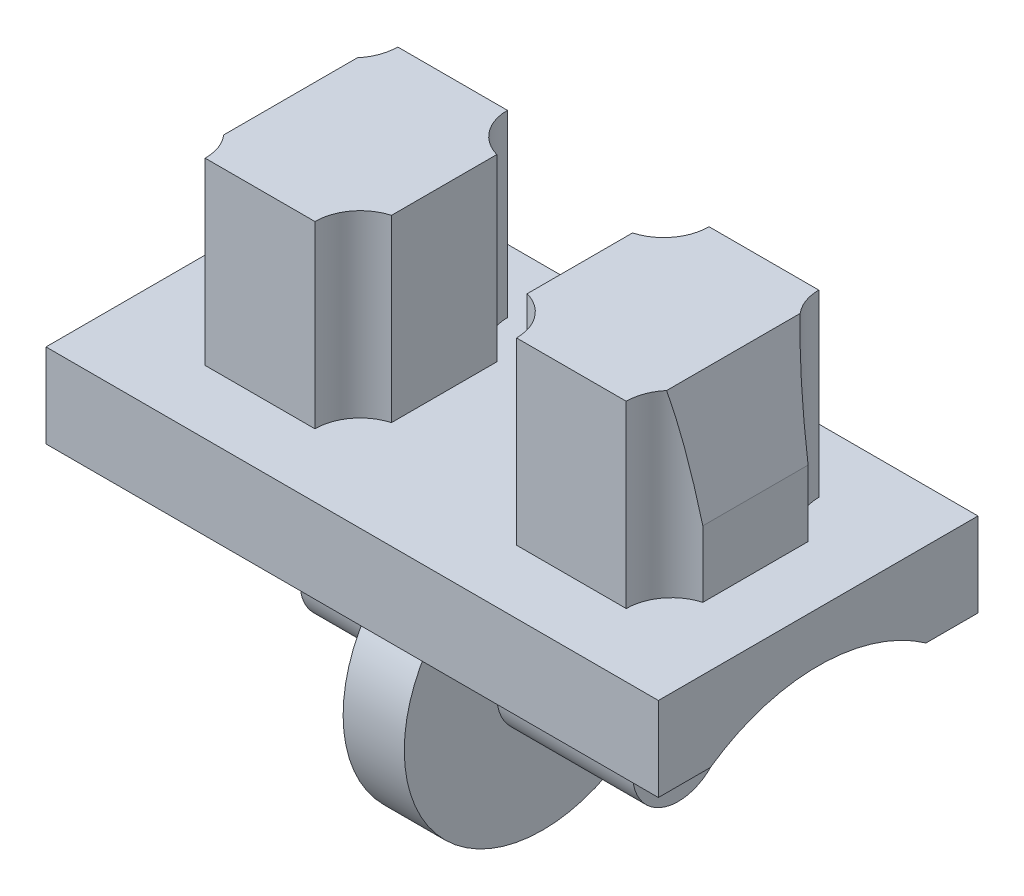
ISO-10303-21;
HEADER;
FILE_DESCRIPTION(('STEP AP214'),'2;1');
FILE_NAME('part.step','',(''),(''),'','','');
FILE_SCHEMA(('AUTOMOTIVE_DESIGN { 1 0 10303 214 1 1 1 1 }'));
ENDSEC;
DATA;
#1=APPLICATION_CONTEXT('core data for automotive mechanical design processes');
#2=APPLICATION_PROTOCOL_DEFINITION('international standard','automotive_design',2000,#1);
#3=PRODUCT_CONTEXT('',#1,'mechanical');
#4=PRODUCT('Part','Part','',(#3));
#5=PRODUCT_RELATED_PRODUCT_CATEGORY('part','',(#4));
#6=PRODUCT_DEFINITION_FORMATION('','',#4);
#7=PRODUCT_DEFINITION_CONTEXT('part definition',#1,'design');
#8=PRODUCT_DEFINITION('design','',#6,#7);
#9=PRODUCT_DEFINITION_SHAPE('','',#8);
#10=(LENGTH_UNIT() NAMED_UNIT(*) SI_UNIT(.MILLI.,.METRE.));
#11=(NAMED_UNIT(*) PLANE_ANGLE_UNIT() SI_UNIT($,.RADIAN.));
#12=(NAMED_UNIT(*) SI_UNIT($,.STERADIAN.) SOLID_ANGLE_UNIT());
#13=UNCERTAINTY_MEASURE_WITH_UNIT(LENGTH_MEASURE(1.E-05),#10,'distance_accuracy_value','');
#14=(GEOMETRIC_REPRESENTATION_CONTEXT(3) GLOBAL_UNCERTAINTY_ASSIGNED_CONTEXT((#13)) GLOBAL_UNIT_ASSIGNED_CONTEXT((#10,
#11,#12)) REPRESENTATION_CONTEXT('',''));
#15=CARTESIAN_POINT('',(0.,0.,0.));
#16=DIRECTION('',(0.,0.,1.));
#17=DIRECTION('',(1.,0.,0.));
#18=AXIS2_PLACEMENT_3D('',#15,#16,#17);
#19=CARTESIAN_POINT('',(6.485,9.41,2.44));
#20=DIRECTION('',(0.,-1.,0.));
#21=DIRECTION('',(0.,0.,-1.));
#22=AXIS2_PLACEMENT_3D('',#19,#20,#21);
#23=CYLINDRICAL_SURFACE('',#22,1.15);
#24=DIRECTION('',(0.,-1.,0.));
#25=VECTOR('',#24,1.);
#26=CARTESIAN_POINT('',(6.17,9.41,1.33398236903745));
#27=LINE('',#26,#25);
#28=CARTESIAN_POINT('',(6.17,6.54,1.33398236903745));
#29=VERTEX_POINT('',#28);
#30=CARTESIAN_POINT('',(6.17,4.86,1.33398236903745));
#31=VERTEX_POINT('',#30);
#32=EDGE_CURVE('E253',#29,#31,#27,.T.);
#33=ORIENTED_EDGE('',*,*,#32,.F.);
#34=CARTESIAN_POINT('',(6.485,4.92248016374453,2.44));
#35=DIRECTION('',(0.981560518740634,0.191151636272402,0.));
#36=DIRECTION('',(0.191151636272402,-0.981560518740634,0.));
#37=AXIS2_PLACEMENT_3D('',#34,#35,#36);
#38=ELLIPSE('',#37,6.01616613085741,1.15);
#39=CARTESIAN_POINT('',(5.611088770761,9.41,1.69248467346148));
#40=VERTEX_POINT('',#39);
#41=EDGE_CURVE('E242',#29,#40,#38,.T.);
#42=ORIENTED_EDGE('',*,*,#41,.T.);
#43=CARTESIAN_POINT('',(6.485,9.41,2.44));
#44=DIRECTION('',(0.,1.,0.));
#45=DIRECTION('',(0.,0.,-1.));
#46=AXIS2_PLACEMENT_3D('',#43,#44,#45);
#47=CIRCLE('',#46,1.15);
#48=CARTESIAN_POINT('',(5.335,9.41,2.44));
#49=VERTEX_POINT('',#48);
#50=EDGE_CURVE('E250',#40,#49,#47,.T.);
#51=ORIENTED_EDGE('',*,*,#50,.T.);
#52=DIRECTION('',(0.,-1.,0.));
#53=VECTOR('',#52,1.);
#54=CARTESIAN_POINT('',(5.335,9.41,2.44));
#55=LINE('',#54,#53);
#56=CARTESIAN_POINT('',(5.335,4.86,2.44));
#57=VERTEX_POINT('',#56);
#58=EDGE_CURVE('E309',#49,#57,#55,.T.);
#59=ORIENTED_EDGE('',*,*,#58,.T.);
#60=CARTESIAN_POINT('',(6.485,4.86,2.44));
#61=DIRECTION('',(0.,1.,0.));
#62=DIRECTION('',(0.,0.,-1.));
#63=AXIS2_PLACEMENT_3D('',#60,#61,#62);
#64=CIRCLE('',#63,1.15);
#65=EDGE_CURVE('E283',#31,#57,#64,.T.);
#66=ORIENTED_EDGE('',*,*,#65,.F.);
#67=EDGE_LOOP('',(#33,#42,#51,#59,#66));
#68=FACE_BOUND('',#67,.T.);
#69=ADVANCED_FACE('F35',(#68),#23,.F.);
#70=CARTESIAN_POINT('',(6.17,9.41,-1.33398236903745));
#71=DIRECTION('',(1.,0.,0.));
#72=DIRECTION('',(0.,0.,-1.));
#73=AXIS2_PLACEMENT_3D('',#70,#71,#72);
#74=PLANE('',#73);
#75=DIRECTION('',(0.,-1.,0.));
#76=VECTOR('',#75,1.);
#77=CARTESIAN_POINT('',(6.17,9.41,-1.33398236903745));
#78=LINE('',#77,#76);
#79=CARTESIAN_POINT('',(6.17,6.54,-1.33398236903745));
#80=VERTEX_POINT('',#79);
#81=CARTESIAN_POINT('',(6.17,4.86,-1.33398236903745));
#82=VERTEX_POINT('',#81);
#83=EDGE_CURVE('E306',#80,#82,#78,.T.);
#84=ORIENTED_EDGE('',*,*,#83,.F.);
#85=DIRECTION('',(0.,0.,1.));
#86=VECTOR('',#85,1.);
#87=CARTESIAN_POINT('',(6.17,6.54,-2.5));
#88=LINE('',#87,#86);
#89=EDGE_CURVE('E977',#80,#29,#88,.T.);
#90=ORIENTED_EDGE('',*,*,#89,.T.);
#91=ORIENTED_EDGE('',*,*,#32,.T.);
#92=DIRECTION('',(0.,0.,1.));
#93=VECTOR('',#92,1.);
#94=CARTESIAN_POINT('',(6.17,4.86,-1.33398236903745));
#95=LINE('',#94,#93);
#96=EDGE_CURVE('E286',#82,#31,#95,.T.);
#97=ORIENTED_EDGE('',*,*,#96,.F.);
#98=EDGE_LOOP('',(#84,#90,#91,#97));
#99=FACE_BOUND('',#98,.T.);
#100=ADVANCED_FACE('F544',(#99),#74,.T.);
#101=CARTESIAN_POINT('',(6.485,9.41,-2.44));
#102=DIRECTION('',(0.,-1.,0.));
#103=DIRECTION('',(0.,0.,-1.));
#104=AXIS2_PLACEMENT_3D('',#101,#102,#103);
#105=CYLINDRICAL_SURFACE('',#104,1.15);
#106=CARTESIAN_POINT('',(6.485,9.41,-2.44));
#107=DIRECTION('',(0.,1.,0.));
#108=DIRECTION('',(0.,0.,-1.));
#109=AXIS2_PLACEMENT_3D('',#106,#107,#108);
#110=CIRCLE('',#109,1.15);
#111=CARTESIAN_POINT('',(5.335,9.41,-2.44));
#112=VERTEX_POINT('',#111);
#113=CARTESIAN_POINT('',(5.611088770761,9.41,-1.69248467346148));
#114=VERTEX_POINT('',#113);
#115=EDGE_CURVE('E261',#112,#114,#110,.T.);
#116=ORIENTED_EDGE('',*,*,#115,.T.);
#117=CARTESIAN_POINT('',(6.485,4.92248016374453,-2.44));
#118=DIRECTION('',(0.981560518740634,0.191151636272402,0.));
#119=DIRECTION('',(0.191151636272402,-0.981560518740634,0.));
#120=AXIS2_PLACEMENT_3D('',#117,#118,#119);
#121=ELLIPSE('',#120,6.01616613085741,1.15);
#122=EDGE_CURVE('E50',#114,#80,#121,.T.);
#123=ORIENTED_EDGE('',*,*,#122,.T.);
#124=ORIENTED_EDGE('',*,*,#83,.T.);
#125=CARTESIAN_POINT('',(6.485,4.86,-2.44));
#126=DIRECTION('',(0.,1.,0.));
#127=DIRECTION('',(0.,0.,-1.));
#128=AXIS2_PLACEMENT_3D('',#125,#126,#127);
#129=CIRCLE('',#128,1.15);
#130=CARTESIAN_POINT('',(5.335,4.86,-2.44));
#131=VERTEX_POINT('',#130);
#132=EDGE_CURVE('E289',#131,#82,#129,.T.);
#133=ORIENTED_EDGE('',*,*,#132,.F.);
#134=DIRECTION('',(0.,-1.,0.));
#135=VECTOR('',#134,1.);
#136=CARTESIAN_POINT('',(5.335,9.41,-2.44));
#137=LINE('',#136,#135);
#138=EDGE_CURVE('E304',#112,#131,#137,.T.);
#139=ORIENTED_EDGE('',*,*,#138,.F.);
#140=EDGE_LOOP('',(#116,#123,#124,#133,#139));
#141=FACE_BOUND('',#140,.T.);
#142=ADVANCED_FACE('F549',(#141),#105,.F.);
#143=CARTESIAN_POINT('',(1.405,9.41,2.44));
#144=DIRECTION('',(0.,1.,0.));
#145=DIRECTION('',(0.,0.,1.));
#146=AXIS2_PLACEMENT_3D('',#143,#144,#145);
#147=PLANE('',#146);
#148=ORIENTED_EDGE('',*,*,#50,.F.);
#149=DIRECTION('',(0.,0.,-1.));
#150=VECTOR('',#149,1.);
#151=CARTESIAN_POINT('',(5.611088770761,9.41,2.44));
#152=LINE('',#151,#150);
#153=EDGE_CURVE('E11',#40,#114,#152,.T.);
#154=ORIENTED_EDGE('',*,*,#153,.T.);
#155=ORIENTED_EDGE('',*,*,#115,.F.);
#156=DIRECTION('',(1.,0.,0.));
#157=VECTOR('',#156,1.);
#158=CARTESIAN_POINT('',(2.555,9.41,-2.44));
#159=LINE('',#158,#157);
#160=CARTESIAN_POINT('',(2.555,9.41,-2.44));
#161=VERTEX_POINT('',#160);
#162=EDGE_CURVE('E263',#161,#112,#159,.T.);
#163=ORIENTED_EDGE('',*,*,#162,.F.);
#164=CARTESIAN_POINT('',(1.405,9.41,-2.44));
#165=DIRECTION('',(0.,1.,0.));
#166=DIRECTION('',(0.,0.,1.));
#167=AXIS2_PLACEMENT_3D('',#164,#165,#166);
#168=CIRCLE('',#167,1.15);
#169=CARTESIAN_POINT('',(1.72,9.41,-1.33398236903745));
#170=VERTEX_POINT('',#169);
#171=EDGE_CURVE('E271',#170,#161,#168,.T.);
#172=ORIENTED_EDGE('',*,*,#171,.F.);
#173=DIRECTION('',(0.,0.,-1.));
#174=VECTOR('',#173,1.);
#175=CARTESIAN_POINT('',(1.72,9.41,-1.33398236903745));
#176=LINE('',#175,#174);
#177=CARTESIAN_POINT('',(1.72,9.41,1.33398236903745));
#178=VERTEX_POINT('',#177);
#179=EDGE_CURVE('E274',#178,#170,#176,.T.);
#180=ORIENTED_EDGE('',*,*,#179,.F.);
#181=CARTESIAN_POINT('',(1.405,9.41,2.44));
#182=DIRECTION('',(0.,1.,0.));
#183=DIRECTION('',(0.,0.,1.));
#184=AXIS2_PLACEMENT_3D('',#181,#182,#183);
#185=CIRCLE('',#184,1.15);
#186=CARTESIAN_POINT('',(2.555,9.41,2.44));
#187=VERTEX_POINT('',#186);
#188=EDGE_CURVE('E265',#187,#178,#185,.T.);
#189=ORIENTED_EDGE('',*,*,#188,.F.);
#190=DIRECTION('',(-1.,0.,0.));
#191=VECTOR('',#190,1.);
#192=CARTESIAN_POINT('',(2.555,9.41,2.44));
#193=LINE('',#192,#191);
#194=EDGE_CURVE('E260',#49,#187,#193,.T.);
#195=ORIENTED_EDGE('',*,*,#194,.F.);
#196=EDGE_LOOP('',(#148,#154,#155,#163,#172,#180,#189,#195));
#197=FACE_BOUND('',#196,.T.);
#198=ADVANCED_FACE('F257',(#197),#147,.T.);
#199=CARTESIAN_POINT('',(7.76,4.86,4.05));
#200=DIRECTION('',(0.,-1.,0.));
#201=DIRECTION('',(0.,0.,-1.));
#202=AXIS2_PLACEMENT_3D('',#199,#200,#201);
#203=PLANE('',#202);
#204=DIRECTION('',(-1.,0.,0.));
#205=VECTOR('',#204,1.);
#206=CARTESIAN_POINT('',(2.555,4.86,2.44));
#207=LINE('',#206,#205);
#208=CARTESIAN_POINT('',(2.555,4.86,2.44));
#209=VERTEX_POINT('',#208);
#210=EDGE_CURVE('E280',#57,#209,#207,.T.);
#211=ORIENTED_EDGE('',*,*,#210,.T.);
#212=CARTESIAN_POINT('',(1.405,4.86,2.44));
#213=DIRECTION('',(0.,1.,0.));
#214=DIRECTION('',(0.,0.,1.));
#215=AXIS2_PLACEMENT_3D('',#212,#213,#214);
#216=CIRCLE('',#215,1.15);
#217=CARTESIAN_POINT('',(1.72,4.86,1.33398236903745));
#218=VERTEX_POINT('',#217);
#219=EDGE_CURVE('E254',#209,#218,#216,.T.);
#220=ORIENTED_EDGE('',*,*,#219,.T.);
#221=DIRECTION('',(0.,0.,-1.));
#222=VECTOR('',#221,1.);
#223=CARTESIAN_POINT('',(1.72,4.86,-1.33398236903745));
#224=LINE('',#223,#222);
#225=CARTESIAN_POINT('',(1.72,4.86,-1.33398236903745));
#226=VERTEX_POINT('',#225);
#227=EDGE_CURVE('E296',#218,#226,#224,.T.);
#228=ORIENTED_EDGE('',*,*,#227,.T.);
#229=CARTESIAN_POINT('',(1.405,4.86,-2.44));
#230=DIRECTION('',(0.,1.,0.));
#231=DIRECTION('',(0.,0.,1.));
#232=AXIS2_PLACEMENT_3D('',#229,#230,#231);
#233=CIRCLE('',#232,1.15);
#234=CARTESIAN_POINT('',(2.555,4.86,-2.44));
#235=VERTEX_POINT('',#234);
#236=EDGE_CURVE('E57',#226,#235,#233,.T.);
#237=ORIENTED_EDGE('',*,*,#236,.T.);
#238=DIRECTION('',(1.,0.,0.));
#239=VECTOR('',#238,1.);
#240=CARTESIAN_POINT('',(2.555,4.86,-2.44));
#241=LINE('',#240,#239);
#242=EDGE_CURVE('E292',#235,#131,#241,.T.);
#243=ORIENTED_EDGE('',*,*,#242,.T.);
#244=ORIENTED_EDGE('',*,*,#132,.T.);
#245=ORIENTED_EDGE('',*,*,#96,.T.);
#246=ORIENTED_EDGE('',*,*,#65,.T.);
#247=EDGE_LOOP('',(#211,#220,#228,#237,#243,#244,#245,#246));
#248=FACE_BOUND('',#247,.T.);
#249=DIRECTION('',(0.,0.,1.));
#250=VECTOR('',#249,1.);
#251=CARTESIAN_POINT('',(-7.76,4.86,4.05));
#252=LINE('',#251,#250);
#253=CARTESIAN_POINT('',(-7.76,4.86,-4.05));
#254=VERTEX_POINT('',#253);
#255=CARTESIAN_POINT('',(-7.76,4.86,4.05));
#256=VERTEX_POINT('',#255);
#257=EDGE_CURVE('E412',#254,#256,#252,.T.);
#258=ORIENTED_EDGE('',*,*,#257,.T.);
#259=DIRECTION('',(-1.,0.,0.));
#260=VECTOR('',#259,1.);
#261=CARTESIAN_POINT('',(7.76,4.86,4.05));
#262=LINE('',#261,#260);
#263=CARTESIAN_POINT('',(7.76,4.86,4.05));
#264=VERTEX_POINT('',#263);
#265=EDGE_CURVE('E432',#264,#256,#262,.T.);
#266=ORIENTED_EDGE('',*,*,#265,.F.);
#267=DIRECTION('',(0.,0.,1.));
#268=VECTOR('',#267,1.);
#269=CARTESIAN_POINT('',(7.76,4.86,4.05));
#270=LINE('',#269,#268);
#271=CARTESIAN_POINT('',(7.76,4.86,-4.05));
#272=VERTEX_POINT('',#271);
#273=EDGE_CURVE('E394',#272,#264,#270,.T.);
#274=ORIENTED_EDGE('',*,*,#273,.F.);
#275=DIRECTION('',(-1.,0.,0.));
#276=VECTOR('',#275,1.);
#277=CARTESIAN_POINT('',(7.76,4.86,-4.05));
#278=LINE('',#277,#276);
#279=EDGE_CURVE('E435',#272,#254,#278,.T.);
#280=ORIENTED_EDGE('',*,*,#279,.T.);
#281=EDGE_LOOP('',(#258,#266,#274,#280));
#282=FACE_BOUND('',#281,.T.);
#283=CARTESIAN_POINT('',(-1.405,4.86,2.44));
#284=DIRECTION('',(0.,-1.,0.));
#285=DIRECTION('',(0.,0.,1.));
#286=AXIS2_PLACEMENT_3D('',#283,#284,#285);
#287=CIRCLE('',#286,1.15);
#288=CARTESIAN_POINT('',(-2.555,4.86,2.44));
#289=VERTEX_POINT('',#288);
#290=CARTESIAN_POINT('',(-1.72,4.86,1.33398236903745));
#291=VERTEX_POINT('',#290);
#292=EDGE_CURVE('E321',#289,#291,#287,.T.);
#293=ORIENTED_EDGE('',*,*,#292,.F.);
#294=DIRECTION('',(1.,0.,0.));
#295=VECTOR('',#294,1.);
#296=CARTESIAN_POINT('',(-2.555,4.86,2.44));
#297=LINE('',#296,#295);
#298=CARTESIAN_POINT('',(-5.335,4.86,2.44));
#299=VERTEX_POINT('',#298);
#300=EDGE_CURVE('E326',#299,#289,#297,.T.);
#301=ORIENTED_EDGE('',*,*,#300,.F.);
#302=CARTESIAN_POINT('',(-6.485,4.86,2.44));
#303=DIRECTION('',(0.,-1.,0.));
#304=DIRECTION('',(0.,0.,-1.));
#305=AXIS2_PLACEMENT_3D('',#302,#303,#304);
#306=CIRCLE('',#305,1.15);
#307=CARTESIAN_POINT('',(-6.17,4.86,1.33398236903745));
#308=VERTEX_POINT('',#307);
#309=EDGE_CURVE('E357',#308,#299,#306,.T.);
#310=ORIENTED_EDGE('',*,*,#309,.F.);
#311=DIRECTION('',(0.,0.,1.));
#312=VECTOR('',#311,1.);
#313=CARTESIAN_POINT('',(-6.17,4.86,-1.33398236903745));
#314=LINE('',#313,#312);
#315=CARTESIAN_POINT('',(-6.17,4.86,-1.33398236903745));
#316=VERTEX_POINT('',#315);
#317=EDGE_CURVE('E354',#316,#308,#314,.T.);
#318=ORIENTED_EDGE('',*,*,#317,.F.);
#319=CARTESIAN_POINT('',(-6.485,4.86,-2.44));
#320=DIRECTION('',(0.,-1.,0.));
#321=DIRECTION('',(0.,0.,-1.));
#322=AXIS2_PLACEMENT_3D('',#319,#320,#321);
#323=CIRCLE('',#322,1.15);
#324=CARTESIAN_POINT('',(-5.335,4.86,-2.44));
#325=VERTEX_POINT('',#324);
#326=EDGE_CURVE('E351',#325,#316,#323,.T.);
#327=ORIENTED_EDGE('',*,*,#326,.F.);
#328=DIRECTION('',(-1.,0.,0.));
#329=VECTOR('',#328,1.);
#330=CARTESIAN_POINT('',(-2.555,4.86,-2.44));
#331=LINE('',#330,#329);
#332=CARTESIAN_POINT('',(-2.555,4.86,-2.44));
#333=VERTEX_POINT('',#332);
#334=EDGE_CURVE('E348',#333,#325,#331,.T.);
#335=ORIENTED_EDGE('',*,*,#334,.F.);
#336=CARTESIAN_POINT('',(-1.405,4.86,-2.44));
#337=DIRECTION('',(0.,-1.,0.));
#338=DIRECTION('',(0.,0.,1.));
#339=AXIS2_PLACEMENT_3D('',#336,#337,#338);
#340=CIRCLE('',#339,1.15);
#341=CARTESIAN_POINT('',(-1.72,4.86,-1.33398236903745));
#342=VERTEX_POINT('',#341);
#343=EDGE_CURVE('E345',#342,#333,#340,.T.);
#344=ORIENTED_EDGE('',*,*,#343,.F.);
#345=DIRECTION('',(0.,0.,-1.));
#346=VECTOR('',#345,1.);
#347=CARTESIAN_POINT('',(-1.72,4.86,-1.33398236903745));
#348=LINE('',#347,#346);
#349=EDGE_CURVE('E342',#291,#342,#348,.T.);
#350=ORIENTED_EDGE('',*,*,#349,.F.);
#351=EDGE_LOOP('',(#293,#301,#310,#318,#327,#335,#344,#350));
#352=FACE_BOUND('',#351,.T.);
#353=ADVANCED_FACE('F514',(#248,#282,#352),#203,.F.);
#354=CARTESIAN_POINT('',(0.775,2.73210689330767,-2.73));
#355=DIRECTION('',(0.,0.,1.));
#356=DIRECTION('',(1.,0.,0.));
#357=AXIS2_PLACEMENT_3D('',#354,#355,#356);
#358=PLANE('',#357);
#359=DIRECTION('',(-1.,0.,0.));
#360=VECTOR('',#359,1.);
#361=CARTESIAN_POINT('',(7.76,2.73,-2.73));
#362=LINE('',#361,#360);
#363=CARTESIAN_POINT('',(0.775,2.73,-2.73));
#364=VERTEX_POINT('',#363);
#365=CARTESIAN_POINT('',(-0.775,2.73,-2.73));
#366=VERTEX_POINT('',#365);
#367=EDGE_CURVE('E446',#364,#366,#362,.T.);
#368=ORIENTED_EDGE('',*,*,#367,.F.);
#369=DIRECTION('',(0.,1.,0.));
#370=VECTOR('',#369,1.);
#371=CARTESIAN_POINT('',(0.775,2.73210689330767,-2.73));
#372=LINE('',#371,#370);
#373=CARTESIAN_POINT('',(0.775,2.19820949866022,-2.73));
#374=VERTEX_POINT('',#373);
#375=EDGE_CURVE('E465',#374,#364,#372,.T.);
#376=ORIENTED_EDGE('',*,*,#375,.F.);
#377=DIRECTION('',(-1.,0.,0.));
#378=VECTOR('',#377,1.);
#379=CARTESIAN_POINT('',(0.775,2.19820949866022,-2.73));
#380=LINE('',#379,#378);
#381=CARTESIAN_POINT('',(-0.775,2.19820949866022,-2.73));
#382=VERTEX_POINT('',#381);
#383=EDGE_CURVE('E490',#374,#382,#380,.T.);
#384=ORIENTED_EDGE('',*,*,#383,.T.);
#385=DIRECTION('',(0.,1.,0.));
#386=VECTOR('',#385,1.);
#387=CARTESIAN_POINT('',(-0.775,2.73210689330767,-2.73));
#388=LINE('',#387,#386);
#389=EDGE_CURVE('E479',#382,#366,#388,.T.);
#390=ORIENTED_EDGE('',*,*,#389,.T.);
#391=EDGE_LOOP('',(#368,#376,#384,#390));
#392=FACE_BOUND('',#391,.T.);
#393=ADVANCED_FACE('F711',(#392),#358,.F.);
#394=CARTESIAN_POINT('',(0.775,2.73210689330767,2.73));
#395=DIRECTION('',(0.,0.,-1.));
#396=DIRECTION('',(-1.,0.,0.));
#397=AXIS2_PLACEMENT_3D('',#394,#395,#396);
#398=PLANE('',#397);
#399=DIRECTION('',(-1.,0.,0.));
#400=VECTOR('',#399,1.);
#401=CARTESIAN_POINT('',(7.76,2.73,2.73));
#402=LINE('',#401,#400);
#403=CARTESIAN_POINT('',(0.775,2.73,2.73));
#404=VERTEX_POINT('',#403);
#405=CARTESIAN_POINT('',(-0.775,2.73,2.73));
#406=VERTEX_POINT('',#405);
#407=EDGE_CURVE('E429',#404,#406,#402,.T.);
#408=ORIENTED_EDGE('',*,*,#407,.T.);
#409=DIRECTION('',(0.,-1.,0.));
#410=VECTOR('',#409,1.);
#411=CARTESIAN_POINT('',(-0.775,2.73210689330767,2.73));
#412=LINE('',#411,#410);
#413=CARTESIAN_POINT('',(-0.775,2.19820949866022,2.73));
#414=VERTEX_POINT('',#413);
#415=EDGE_CURVE('E485',#406,#414,#412,.T.);
#416=ORIENTED_EDGE('',*,*,#415,.T.);
#417=DIRECTION('',(-1.,0.,0.));
#418=VECTOR('',#417,1.);
#419=CARTESIAN_POINT('',(0.775,2.19820949866022,2.73));
#420=LINE('',#419,#418);
#421=CARTESIAN_POINT('',(0.775,2.19820949866022,2.73));
#422=VERTEX_POINT('',#421);
#423=EDGE_CURVE('E475',#422,#414,#420,.T.);
#424=ORIENTED_EDGE('',*,*,#423,.F.);
#425=DIRECTION('',(0.,-1.,0.));
#426=VECTOR('',#425,1.);
#427=CARTESIAN_POINT('',(0.775,2.73210689330767,2.73));
#428=LINE('',#427,#426);
#429=EDGE_CURVE('E471',#404,#422,#428,.T.);
#430=ORIENTED_EDGE('',*,*,#429,.F.);
#431=EDGE_LOOP('',(#408,#416,#424,#430));
#432=FACE_BOUND('',#431,.T.);
#433=ADVANCED_FACE('F825',(#432),#398,.F.);
#434=CARTESIAN_POINT('',(0.775,0.,0.));
#435=DIRECTION('',(-1.,0.,0.));
#436=DIRECTION('',(0.,0.,1.));
#437=AXIS2_PLACEMENT_3D('',#434,#435,#436);
#438=CYLINDRICAL_SURFACE('',#437,3.505);
#439=CARTESIAN_POINT('',(-0.775,0.,0.));
#440=DIRECTION('',(1.,0.,0.));
#441=DIRECTION('',(0.,0.,-1.));
#442=AXIS2_PLACEMENT_3D('',#439,#440,#441);
#443=CIRCLE('',#442,3.505);
#444=EDGE_CURVE('E461',#414,#382,#443,.T.);
#445=ORIENTED_EDGE('',*,*,#444,.T.);
#446=ORIENTED_EDGE('',*,*,#383,.F.);
#447=CARTESIAN_POINT('',(0.775,0.,0.));
#448=DIRECTION('',(1.,0.,0.));
#449=DIRECTION('',(0.,0.,-1.));
#450=AXIS2_PLACEMENT_3D('',#447,#448,#449);
#451=CIRCLE('',#450,3.505);
#452=EDGE_CURVE('E462',#422,#374,#451,.T.);
#453=ORIENTED_EDGE('',*,*,#452,.F.);
#454=ORIENTED_EDGE('',*,*,#423,.T.);
#455=EDGE_LOOP('',(#445,#446,#453,#454));
#456=FACE_BOUND('',#455,.T.);
#457=ADVANCED_FACE('F37',(#456),#438,.T.);
#458=CARTESIAN_POINT('',(0.775,0.,0.));
#459=DIRECTION('',(1.,0.,0.));
#460=DIRECTION('',(0.,0.,-1.));
#461=AXIS2_PLACEMENT_3D('',#458,#459,#460);
#462=PLANE('',#461);
#463=CARTESIAN_POINT('',(0.775,0.,0.));
#464=DIRECTION('',(1.,0.,0.));
#465=DIRECTION('',(0.,0.,-1.));
#466=AXIS2_PLACEMENT_3D('',#463,#464,#465);
#467=CIRCLE('',#466,1.155);
#468=CARTESIAN_POINT('',(0.775,0.,-1.155));
#469=VERTEX_POINT('',#468);
#470=EDGE_CURVE('E456',#469,#469,#467,.F.);
#471=ORIENTED_EDGE('',*,*,#470,.T.);
#472=EDGE_LOOP('',(#471));
#473=FACE_BOUND('',#472,.T.);
#474=ORIENTED_EDGE('',*,*,#452,.T.);
#475=ORIENTED_EDGE('',*,*,#375,.T.);
#476=DIRECTION('',(0.,1.,0.));
#477=VECTOR('',#476,1.);
#478=CARTESIAN_POINT('',(0.775,0.,-2.73));
#479=LINE('',#478,#477);
#480=CARTESIAN_POINT('',(0.775,2.73210689330767,-2.73));
#481=VERTEX_POINT('',#480);
#482=EDGE_CURVE('E450',#364,#481,#479,.T.);
#483=ORIENTED_EDGE('',*,*,#482,.T.);
#484=CARTESIAN_POINT('',(0.775,-1.155,0.));
#485=DIRECTION('',(1.,0.,0.));
#486=DIRECTION('',(0.,0.,-1.));
#487=AXIS2_PLACEMENT_3D('',#484,#485,#486);
#488=CIRCLE('',#487,4.75);
#489=CARTESIAN_POINT('',(0.775,2.73210689330767,2.73));
#490=VERTEX_POINT('',#489);
#491=EDGE_CURVE('E469',#481,#490,#488,.T.);
#492=ORIENTED_EDGE('',*,*,#491,.T.);
#493=EDGE_CURVE('E472',#490,#404,#428,.T.);
#494=ORIENTED_EDGE('',*,*,#493,.T.);
#495=ORIENTED_EDGE('',*,*,#429,.T.);
#496=EDGE_LOOP('',(#474,#475,#483,#492,#494,#495));
#497=FACE_BOUND('',#496,.T.);
#498=ADVANCED_FACE('F877',(#473,#497),#462,.T.);
#499=CARTESIAN_POINT('',(-0.775,0.,0.));
#500=DIRECTION('',(1.,0.,0.));
#501=DIRECTION('',(0.,0.,-1.));
#502=AXIS2_PLACEMENT_3D('',#499,#500,#501);
#503=PLANE('',#502);
#504=CARTESIAN_POINT('',(-0.775,0.,0.));
#505=DIRECTION('',(1.,0.,0.));
#506=DIRECTION('',(0.,0.,-1.));
#507=AXIS2_PLACEMENT_3D('',#504,#505,#506);
#508=CIRCLE('',#507,1.155);
#509=CARTESIAN_POINT('',(-0.775,0.,-1.155));
#510=VERTEX_POINT('',#509);
#511=EDGE_CURVE('E493',#510,#510,#508,.F.);
#512=ORIENTED_EDGE('',*,*,#511,.F.);
#513=EDGE_LOOP('',(#512));
#514=FACE_BOUND('',#513,.T.);
#515=ORIENTED_EDGE('',*,*,#444,.F.);
#516=ORIENTED_EDGE('',*,*,#415,.F.);
#517=CARTESIAN_POINT('',(-0.775,2.73210689330767,2.73));
#518=VERTEX_POINT('',#517);
#519=EDGE_CURVE('E466',#518,#406,#412,.T.);
#520=ORIENTED_EDGE('',*,*,#519,.F.);
#521=CARTESIAN_POINT('',(-0.775,-1.155,0.));
#522=DIRECTION('',(1.,0.,0.));
#523=DIRECTION('',(0.,0.,-1.));
#524=AXIS2_PLACEMENT_3D('',#521,#522,#523);
#525=CIRCLE('',#524,4.75);
#526=CARTESIAN_POINT('',(-0.775,2.73210689330767,-2.73));
#527=VERTEX_POINT('',#526);
#528=EDGE_CURVE('E482',#527,#518,#525,.T.);
#529=ORIENTED_EDGE('',*,*,#528,.F.);
#530=EDGE_CURVE('E478',#366,#527,#388,.T.);
#531=ORIENTED_EDGE('',*,*,#530,.F.);
#532=ORIENTED_EDGE('',*,*,#389,.F.);
#533=EDGE_LOOP('',(#515,#516,#520,#529,#531,#532));
#534=FACE_BOUND('',#533,.T.);
#535=ADVANCED_FACE('F868',(#514,#534),#503,.F.);
#536=CARTESIAN_POINT('',(-4.215,0.,0.));
#537=DIRECTION('',(1.,0.,0.));
#538=DIRECTION('',(0.,0.,-1.));
#539=AXIS2_PLACEMENT_3D('',#536,#537,#538);
#540=PLANE('',#539);
#541=CARTESIAN_POINT('',(-4.215,0.,0.));
#542=DIRECTION('',(1.,0.,0.));
#543=DIRECTION('',(0.,0.,-1.));
#544=AXIS2_PLACEMENT_3D('',#541,#542,#543);
#545=CIRCLE('',#544,1.155);
#546=CARTESIAN_POINT('',(-4.215,0.,-1.155));
#547=VERTEX_POINT('',#546);
#548=EDGE_CURVE('E452',#547,#547,#545,.T.);
#549=ORIENTED_EDGE('',*,*,#548,.F.);
#550=EDGE_LOOP('',(#549));
#551=FACE_BOUND('',#550,.T.);
#552=ADVANCED_FACE('F860',(#551),#540,.F.);
#553=CARTESIAN_POINT('',(4.215,0.,0.));
#554=DIRECTION('',(-1.,0.,0.));
#555=DIRECTION('',(0.,0.,1.));
#556=AXIS2_PLACEMENT_3D('',#553,#554,#555);
#557=CYLINDRICAL_SURFACE('',#556,1.155);
#558=ORIENTED_EDGE('',*,*,#548,.T.);
#559=EDGE_LOOP('',(#558));
#560=FACE_BOUND('',#559,.T.);
#561=ORIENTED_EDGE('',*,*,#511,.T.);
#562=EDGE_LOOP('',(#561));
#563=FACE_BOUND('',#562,.T.);
#564=ADVANCED_FACE('F851',(#560,#563),#557,.T.);
#565=ORIENTED_EDGE('',*,*,#470,.F.);
#566=EDGE_LOOP('',(#565));
#567=FACE_BOUND('',#566,.T.);
#568=CARTESIAN_POINT('',(4.215,0.,0.));
#569=DIRECTION('',(1.,0.,0.));
#570=DIRECTION('',(0.,0.,-1.));
#571=AXIS2_PLACEMENT_3D('',#568,#569,#570);
#572=CIRCLE('',#571,1.155);
#573=CARTESIAN_POINT('',(4.215,0.,-1.155));
#574=VERTEX_POINT('',#573);
#575=EDGE_CURVE('E453',#574,#574,#572,.T.);
#576=ORIENTED_EDGE('',*,*,#575,.F.);
#577=EDGE_LOOP('',(#576));
#578=FACE_BOUND('',#577,.T.);
#579=ADVANCED_FACE('F842',(#567,#578),#557,.T.);
#580=CARTESIAN_POINT('',(4.215,0.,0.));
#581=DIRECTION('',(1.,0.,0.));
#582=DIRECTION('',(0.,0.,-1.));
#583=AXIS2_PLACEMENT_3D('',#580,#581,#582);
#584=PLANE('',#583);
#585=ORIENTED_EDGE('',*,*,#575,.T.);
#586=EDGE_LOOP('',(#585));
#587=FACE_BOUND('',#586,.T.);
#588=ADVANCED_FACE('F816',(#587),#584,.T.);
#589=CARTESIAN_POINT('',(7.76,-1.155,0.));
#590=DIRECTION('',(-1.,0.,0.));
#591=DIRECTION('',(0.,0.,1.));
#592=AXIS2_PLACEMENT_3D('',#589,#590,#591);
#593=CYLINDRICAL_SURFACE('',#592,4.75);
#594=DIRECTION('',(-1.,0.,0.));
#595=VECTOR('',#594,1.);
#596=CARTESIAN_POINT('',(7.76,2.73210689330767,-2.73));
#597=LINE('',#596,#595);
#598=CARTESIAN_POINT('',(-7.76,2.73210689330767,-2.73));
#599=VERTEX_POINT('',#598);
#600=EDGE_CURVE('E445',#527,#599,#597,.T.);
#601=ORIENTED_EDGE('',*,*,#600,.F.);
#602=ORIENTED_EDGE('',*,*,#528,.T.);
#603=DIRECTION('',(-1.,0.,0.));
#604=VECTOR('',#603,1.);
#605=CARTESIAN_POINT('',(7.76,2.73210689330767,2.73));
#606=LINE('',#605,#604);
#607=CARTESIAN_POINT('',(-7.76,2.73210689330767,2.73));
#608=VERTEX_POINT('',#607);
#609=EDGE_CURVE('E402',#518,#608,#606,.T.);
#610=ORIENTED_EDGE('',*,*,#609,.T.);
#611=CARTESIAN_POINT('',(-7.76,-1.155,0.));
#612=DIRECTION('',(-1.,0.,0.));
#613=DIRECTION('',(0.,0.,-1.));
#614=AXIS2_PLACEMENT_3D('',#611,#612,#613);
#615=CIRCLE('',#614,4.75);
#616=EDGE_CURVE('E383',#608,#599,#615,.T.);
#617=ORIENTED_EDGE('',*,*,#616,.T.);
#618=EDGE_LOOP('',(#601,#602,#610,#617));
#619=FACE_BOUND('',#618,.T.);
#620=ADVANCED_FACE('F795',(#619),#593,.F.);
#621=CARTESIAN_POINT('',(7.76,2.73,-2.73));
#622=DIRECTION('',(0.,0.,-1.));
#623=DIRECTION('',(-1.,0.,0.));
#624=AXIS2_PLACEMENT_3D('',#621,#622,#623);
#625=PLANE('',#624);
#626=CARTESIAN_POINT('',(-7.76,2.73,-2.73));
#627=VERTEX_POINT('',#626);
#628=EDGE_CURVE('E441',#366,#627,#362,.T.);
#629=ORIENTED_EDGE('',*,*,#628,.F.);
#630=ORIENTED_EDGE('',*,*,#530,.T.);
#631=ORIENTED_EDGE('',*,*,#600,.T.);
#632=DIRECTION('',(0.,-1.,0.));
#633=VECTOR('',#632,1.);
#634=CARTESIAN_POINT('',(-7.76,2.73,-2.73));
#635=LINE('',#634,#633);
#636=EDGE_CURVE('E405',#599,#627,#635,.T.);
#637=ORIENTED_EDGE('',*,*,#636,.T.);
#638=EDGE_LOOP('',(#629,#630,#631,#637));
#639=FACE_BOUND('',#638,.T.);
#640=ADVANCED_FACE('F786',(#639),#625,.F.);
#641=CARTESIAN_POINT('',(7.76,2.73210689330767,2.73));
#642=DIRECTION('',(0.,0.,1.));
#643=DIRECTION('',(1.,0.,0.));
#644=AXIS2_PLACEMENT_3D('',#641,#642,#643);
#645=PLANE('',#644);
#646=ORIENTED_EDGE('',*,*,#609,.F.);
#647=ORIENTED_EDGE('',*,*,#519,.T.);
#648=CARTESIAN_POINT('',(-7.76,2.73,2.73));
#649=VERTEX_POINT('',#648);
#650=EDGE_CURVE('E424',#406,#649,#402,.T.);
#651=ORIENTED_EDGE('',*,*,#650,.T.);
#652=DIRECTION('',(0.,1.,0.));
#653=VECTOR('',#652,1.);
#654=CARTESIAN_POINT('',(-7.76,2.73210689330767,2.73));
#655=LINE('',#654,#653);
#656=EDGE_CURVE('E388',#649,#608,#655,.T.);
#657=ORIENTED_EDGE('',*,*,#656,.T.);
#658=EDGE_LOOP('',(#646,#647,#651,#657));
#659=FACE_BOUND('',#658,.T.);
#660=ADVANCED_FACE('F740',(#659),#645,.F.);
#661=ORIENTED_EDGE('',*,*,#491,.F.);
#662=CARTESIAN_POINT('',(7.76,2.73210689330767,-2.73));
#663=VERTEX_POINT('',#662);
#664=EDGE_CURVE('E447',#663,#481,#597,.T.);
#665=ORIENTED_EDGE('',*,*,#664,.F.);
#666=CARTESIAN_POINT('',(7.76,-1.155,0.));
#667=DIRECTION('',(-1.,0.,0.));
#668=DIRECTION('',(0.,0.,-1.));
#669=AXIS2_PLACEMENT_3D('',#666,#667,#668);
#670=CIRCLE('',#669,4.75);
#671=CARTESIAN_POINT('',(7.76,2.73210689330767,2.73));
#672=VERTEX_POINT('',#671);
#673=EDGE_CURVE('E384',#672,#663,#670,.T.);
#674=ORIENTED_EDGE('',*,*,#673,.F.);
#675=EDGE_CURVE('E421',#672,#490,#606,.T.);
#676=ORIENTED_EDGE('',*,*,#675,.T.);
#677=EDGE_LOOP('',(#661,#665,#674,#676));
#678=FACE_BOUND('',#677,.T.);
#679=ADVANCED_FACE('F783',(#678),#593,.F.);
#680=ORIENTED_EDGE('',*,*,#482,.F.);
#681=CARTESIAN_POINT('',(7.76,2.73,-2.73));
#682=VERTEX_POINT('',#681);
#683=EDGE_CURVE('E442',#682,#364,#362,.T.);
#684=ORIENTED_EDGE('',*,*,#683,.F.);
#685=DIRECTION('',(0.,-1.,0.));
#686=VECTOR('',#685,1.);
#687=CARTESIAN_POINT('',(7.76,2.73,-2.73));
#688=LINE('',#687,#686);
#689=EDGE_CURVE('E387',#663,#682,#688,.T.);
#690=ORIENTED_EDGE('',*,*,#689,.F.);
#691=ORIENTED_EDGE('',*,*,#664,.T.);
#692=EDGE_LOOP('',(#680,#684,#690,#691));
#693=FACE_BOUND('',#692,.T.);
#694=ADVANCED_FACE('F774',(#693),#625,.F.);
#695=CARTESIAN_POINT('',(7.76,2.73,-4.05));
#696=DIRECTION('',(0.,1.,0.));
#697=DIRECTION('',(0.,0.,1.));
#698=AXIS2_PLACEMENT_3D('',#695,#696,#697);
#699=PLANE('',#698);
#700=DIRECTION('',(0.,0.,-1.));
#701=VECTOR('',#700,1.);
#702=CARTESIAN_POINT('',(-7.76,2.73,-4.05));
#703=LINE('',#702,#701);
#704=CARTESIAN_POINT('',(-7.76,2.73,-4.05));
#705=VERTEX_POINT('',#704);
#706=EDGE_CURVE('E408',#627,#705,#703,.T.);
#707=ORIENTED_EDGE('',*,*,#706,.T.);
#708=DIRECTION('',(-1.,0.,0.));
#709=VECTOR('',#708,1.);
#710=CARTESIAN_POINT('',(7.76,2.73,-4.05));
#711=LINE('',#710,#709);
#712=CARTESIAN_POINT('',(7.76,2.73,-4.05));
#713=VERTEX_POINT('',#712);
#714=EDGE_CURVE('E438',#713,#705,#711,.T.);
#715=ORIENTED_EDGE('',*,*,#714,.F.);
#716=DIRECTION('',(0.,0.,-1.));
#717=VECTOR('',#716,1.);
#718=CARTESIAN_POINT('',(7.76,2.73,-4.05));
#719=LINE('',#718,#717);
#720=EDGE_CURVE('E390',#682,#713,#719,.T.);
#721=ORIENTED_EDGE('',*,*,#720,.F.);
#722=ORIENTED_EDGE('',*,*,#683,.T.);
#723=ORIENTED_EDGE('',*,*,#367,.T.);
#724=ORIENTED_EDGE('',*,*,#628,.T.);
#725=EDGE_LOOP('',(#707,#715,#721,#722,#723,#724));
#726=FACE_BOUND('',#725,.T.);
#727=ADVANCED_FACE('F765',(#726),#699,.F.);
#728=CARTESIAN_POINT('',(7.76,2.73,-4.05));
#729=DIRECTION('',(0.,0.,1.));
#730=DIRECTION('',(1.,0.,0.));
#731=AXIS2_PLACEMENT_3D('',#728,#729,#730);
#732=PLANE('',#731);
#733=DIRECTION('',(0.,1.,0.));
#734=VECTOR('',#733,1.);
#735=CARTESIAN_POINT('',(-7.76,2.73,-4.05));
#736=LINE('',#735,#734);
#737=EDGE_CURVE('E410',#705,#254,#736,.T.);
#738=ORIENTED_EDGE('',*,*,#737,.T.);
#739=ORIENTED_EDGE('',*,*,#279,.F.);
#740=DIRECTION('',(0.,1.,0.));
#741=VECTOR('',#740,1.);
#742=CARTESIAN_POINT('',(7.76,2.73,-4.05));
#743=LINE('',#742,#741);
#744=EDGE_CURVE('E392',#713,#272,#743,.T.);
#745=ORIENTED_EDGE('',*,*,#744,.F.);
#746=ORIENTED_EDGE('',*,*,#714,.T.);
#747=EDGE_LOOP('',(#738,#739,#745,#746));
#748=FACE_BOUND('',#747,.T.);
#749=ADVANCED_FACE('F756',(#748),#732,.F.);
#750=CARTESIAN_POINT('',(7.76,4.86,4.05));
#751=DIRECTION('',(0.,0.,-1.));
#752=DIRECTION('',(-1.,0.,0.));
#753=AXIS2_PLACEMENT_3D('',#750,#751,#752);
#754=PLANE('',#753);
#755=DIRECTION('',(0.,-1.,0.));
#756=VECTOR('',#755,1.);
#757=CARTESIAN_POINT('',(-7.76,4.86,4.05));
#758=LINE('',#757,#756);
#759=CARTESIAN_POINT('',(-7.76,2.73,4.05));
#760=VERTEX_POINT('',#759);
#761=EDGE_CURVE('E414',#256,#760,#758,.T.);
#762=ORIENTED_EDGE('',*,*,#761,.T.);
#763=DIRECTION('',(-1.,0.,0.));
#764=VECTOR('',#763,1.);
#765=CARTESIAN_POINT('',(7.76,2.73,4.05));
#766=LINE('',#765,#764);
#767=CARTESIAN_POINT('',(7.76,2.73,4.05));
#768=VERTEX_POINT('',#767);
#769=EDGE_CURVE('E428',#768,#760,#766,.T.);
#770=ORIENTED_EDGE('',*,*,#769,.F.);
#771=DIRECTION('',(0.,-1.,0.));
#772=VECTOR('',#771,1.);
#773=CARTESIAN_POINT('',(7.76,4.86,4.05));
#774=LINE('',#773,#772);
#775=EDGE_CURVE('E396',#264,#768,#774,.T.);
#776=ORIENTED_EDGE('',*,*,#775,.F.);
#777=ORIENTED_EDGE('',*,*,#265,.T.);
#778=EDGE_LOOP('',(#762,#770,#776,#777));
#779=FACE_BOUND('',#778,.T.);
#780=ADVANCED_FACE('F747',(#779),#754,.F.);
#781=CARTESIAN_POINT('',(7.76,2.73,4.05));
#782=DIRECTION('',(0.,1.,0.));
#783=DIRECTION('',(0.,0.,1.));
#784=AXIS2_PLACEMENT_3D('',#781,#782,#783);
#785=PLANE('',#784);
#786=DIRECTION('',(0.,0.,-1.));
#787=VECTOR('',#786,1.);
#788=CARTESIAN_POINT('',(-7.76,2.73,4.05));
#789=LINE('',#788,#787);
#790=EDGE_CURVE('E416',#760,#649,#789,.T.);
#791=ORIENTED_EDGE('',*,*,#790,.T.);
#792=ORIENTED_EDGE('',*,*,#650,.F.);
#793=ORIENTED_EDGE('',*,*,#407,.F.);
#794=CARTESIAN_POINT('',(7.76,2.73,2.73));
#795=VERTEX_POINT('',#794);
#796=EDGE_CURVE('E425',#795,#404,#402,.T.);
#797=ORIENTED_EDGE('',*,*,#796,.F.);
#798=DIRECTION('',(0.,0.,-1.));
#799=VECTOR('',#798,1.);
#800=CARTESIAN_POINT('',(7.76,2.73,4.05));
#801=LINE('',#800,#799);
#802=EDGE_CURVE('E398',#768,#795,#801,.T.);
#803=ORIENTED_EDGE('',*,*,#802,.F.);
#804=ORIENTED_EDGE('',*,*,#769,.T.);
#805=EDGE_LOOP('',(#791,#792,#793,#797,#803,#804));
#806=FACE_BOUND('',#805,.T.);
#807=ADVANCED_FACE('F737',(#806),#785,.F.);
#808=ORIENTED_EDGE('',*,*,#493,.F.);
#809=ORIENTED_EDGE('',*,*,#675,.F.);
#810=DIRECTION('',(0.,1.,0.));
#811=VECTOR('',#810,1.);
#812=CARTESIAN_POINT('',(7.76,2.73210689330767,2.73));
#813=LINE('',#812,#811);
#814=EDGE_CURVE('E400',#795,#672,#813,.T.);
#815=ORIENTED_EDGE('',*,*,#814,.F.);
#816=ORIENTED_EDGE('',*,*,#796,.T.);
#817=EDGE_LOOP('',(#808,#809,#815,#816));
#818=FACE_BOUND('',#817,.T.);
#819=ADVANCED_FACE('F728',(#818),#645,.F.);
#820=CARTESIAN_POINT('',(7.76,-1.155,0.));
#821=DIRECTION('',(1.,0.,0.));
#822=DIRECTION('',(0.,0.,-1.));
#823=AXIS2_PLACEMENT_3D('',#820,#821,#822);
#824=PLANE('',#823);
#825=ORIENTED_EDGE('',*,*,#673,.T.);
#826=ORIENTED_EDGE('',*,*,#689,.T.);
#827=ORIENTED_EDGE('',*,*,#720,.T.);
#828=ORIENTED_EDGE('',*,*,#744,.T.);
#829=ORIENTED_EDGE('',*,*,#273,.T.);
#830=ORIENTED_EDGE('',*,*,#775,.T.);
#831=ORIENTED_EDGE('',*,*,#802,.T.);
#832=ORIENTED_EDGE('',*,*,#814,.T.);
#833=EDGE_LOOP('',(#825,#826,#827,#828,#829,#830,#831,#832));
#834=FACE_BOUND('',#833,.T.);
#835=ADVANCED_FACE('F719',(#834),#824,.T.);
#836=CARTESIAN_POINT('',(-7.76,-1.155,0.));
#837=DIRECTION('',(1.,0.,0.));
#838=DIRECTION('',(0.,0.,-1.));
#839=AXIS2_PLACEMENT_3D('',#836,#837,#838);
#840=PLANE('',#839);
#841=ORIENTED_EDGE('',*,*,#616,.F.);
#842=ORIENTED_EDGE('',*,*,#656,.F.);
#843=ORIENTED_EDGE('',*,*,#790,.F.);
#844=ORIENTED_EDGE('',*,*,#761,.F.);
#845=ORIENTED_EDGE('',*,*,#257,.F.);
#846=ORIENTED_EDGE('',*,*,#737,.F.);
#847=ORIENTED_EDGE('',*,*,#706,.F.);
#848=ORIENTED_EDGE('',*,*,#636,.F.);
#849=EDGE_LOOP('',(#841,#842,#843,#844,#845,#846,#847,#848));
#850=FACE_BOUND('',#849,.T.);
#851=ADVANCED_FACE('F703',(#850),#840,.F.);
#852=CARTESIAN_POINT('',(-1.405,9.41,2.44));
#853=DIRECTION('',(0.,-1.,0.));
#854=DIRECTION('',(0.,0.,-1.));
#855=AXIS2_PLACEMENT_3D('',#852,#853,#854);
#856=CYLINDRICAL_SURFACE('',#855,1.15);
#857=ORIENTED_EDGE('',*,*,#292,.T.);
#858=DIRECTION('',(0.,-1.,0.));
#859=VECTOR('',#858,1.);
#860=CARTESIAN_POINT('',(-1.72,9.41,1.33398236903745));
#861=LINE('',#860,#859);
#862=CARTESIAN_POINT('',(-1.72,9.41,1.33398236903745));
#863=VERTEX_POINT('',#862);
#864=EDGE_CURVE('E380',#863,#291,#861,.T.);
#865=ORIENTED_EDGE('',*,*,#864,.F.);
#866=CARTESIAN_POINT('',(-1.405,9.41,2.44));
#867=DIRECTION('',(0.,-1.,0.));
#868=DIRECTION('',(0.,0.,1.));
#869=AXIS2_PLACEMENT_3D('',#866,#867,#868);
#870=CIRCLE('',#869,1.15);
#871=CARTESIAN_POINT('',(-2.555,9.41,2.44));
#872=VERTEX_POINT('',#871);
#873=EDGE_CURVE('E322',#872,#863,#870,.T.);
#874=ORIENTED_EDGE('',*,*,#873,.F.);
#875=DIRECTION('',(0.,-1.,0.));
#876=VECTOR('',#875,1.);
#877=CARTESIAN_POINT('',(-2.555,9.41,2.44));
#878=LINE('',#877,#876);
#879=EDGE_CURVE('E339',#872,#289,#878,.T.);
#880=ORIENTED_EDGE('',*,*,#879,.T.);
#881=EDGE_LOOP('',(#857,#865,#874,#880));
#882=FACE_BOUND('',#881,.T.);
#883=ADVANCED_FACE('F529',(#882),#856,.F.);
#884=CARTESIAN_POINT('',(-1.72,9.41,-1.33398236903745));
#885=DIRECTION('',(-1.,0.,0.));
#886=DIRECTION('',(0.,0.,1.));
#887=AXIS2_PLACEMENT_3D('',#884,#885,#886);
#888=PLANE('',#887);
#889=ORIENTED_EDGE('',*,*,#349,.T.);
#890=DIRECTION('',(0.,-1.,0.));
#891=VECTOR('',#890,1.);
#892=CARTESIAN_POINT('',(-1.72,9.41,-1.33398236903745));
#893=LINE('',#892,#891);
#894=CARTESIAN_POINT('',(-1.72,9.41,-1.33398236903745));
#895=VERTEX_POINT('',#894);
#896=EDGE_CURVE('E377',#895,#342,#893,.T.);
#897=ORIENTED_EDGE('',*,*,#896,.F.);
#898=DIRECTION('',(0.,0.,-1.));
#899=VECTOR('',#898,1.);
#900=CARTESIAN_POINT('',(-1.72,9.41,-1.33398236903745));
#901=LINE('',#900,#899);
#902=EDGE_CURVE('E325',#863,#895,#901,.T.);
#903=ORIENTED_EDGE('',*,*,#902,.F.);
#904=ORIENTED_EDGE('',*,*,#864,.T.);
#905=EDGE_LOOP('',(#889,#897,#903,#904));
#906=FACE_BOUND('',#905,.T.);
#907=ADVANCED_FACE('F531',(#906),#888,.F.);
#908=CARTESIAN_POINT('',(-1.405,9.41,-2.44));
#909=DIRECTION('',(0.,-1.,0.));
#910=DIRECTION('',(0.,0.,-1.));
#911=AXIS2_PLACEMENT_3D('',#908,#909,#910);
#912=CYLINDRICAL_SURFACE('',#911,1.15);
#913=ORIENTED_EDGE('',*,*,#343,.T.);
#914=DIRECTION('',(0.,-1.,0.));
#915=VECTOR('',#914,1.);
#916=CARTESIAN_POINT('',(-2.555,9.41,-2.44));
#917=LINE('',#916,#915);
#918=CARTESIAN_POINT('',(-2.555,9.41,-2.44));
#919=VERTEX_POINT('',#918);
#920=EDGE_CURVE('E374',#919,#333,#917,.T.);
#921=ORIENTED_EDGE('',*,*,#920,.F.);
#922=CARTESIAN_POINT('',(-1.405,9.41,-2.44));
#923=DIRECTION('',(0.,-1.,0.));
#924=DIRECTION('',(0.,0.,1.));
#925=AXIS2_PLACEMENT_3D('',#922,#923,#924);
#926=CIRCLE('',#925,1.15);
#927=EDGE_CURVE('E328',#895,#919,#926,.T.);
#928=ORIENTED_EDGE('',*,*,#927,.F.);
#929=ORIENTED_EDGE('',*,*,#896,.T.);
#930=EDGE_LOOP('',(#913,#921,#928,#929));
#931=FACE_BOUND('',#930,.T.);
#932=ADVANCED_FACE('F534',(#931),#912,.F.);
#933=CARTESIAN_POINT('',(-2.555,9.41,-2.44));
#934=DIRECTION('',(0.,0.,1.));
#935=DIRECTION('',(1.,0.,0.));
#936=AXIS2_PLACEMENT_3D('',#933,#934,#935);
#937=PLANE('',#936);
#938=ORIENTED_EDGE('',*,*,#334,.T.);
#939=DIRECTION('',(0.,-1.,0.));
#940=VECTOR('',#939,1.);
#941=CARTESIAN_POINT('',(-5.335,9.41,-2.44));
#942=LINE('',#941,#940);
#943=CARTESIAN_POINT('',(-5.335,9.41,-2.44));
#944=VERTEX_POINT('',#943);
#945=EDGE_CURVE('E371',#944,#325,#942,.T.);
#946=ORIENTED_EDGE('',*,*,#945,.F.);
#947=DIRECTION('',(-1.,0.,0.));
#948=VECTOR('',#947,1.);
#949=CARTESIAN_POINT('',(-2.555,9.41,-2.44));
#950=LINE('',#949,#948);
#951=EDGE_CURVE('E330',#919,#944,#950,.T.);
#952=ORIENTED_EDGE('',*,*,#951,.F.);
#953=ORIENTED_EDGE('',*,*,#920,.T.);
#954=EDGE_LOOP('',(#938,#946,#952,#953));
#955=FACE_BOUND('',#954,.T.);
#956=ADVANCED_FACE('F511',(#955),#937,.F.);
#957=CARTESIAN_POINT('',(-6.485,9.41,-2.44));
#958=DIRECTION('',(0.,-1.,0.));
#959=DIRECTION('',(0.,0.,-1.));
#960=AXIS2_PLACEMENT_3D('',#957,#958,#959);
#961=CYLINDRICAL_SURFACE('',#960,1.15);
#962=DIRECTION('',(0.,-1.,0.));
#963=VECTOR('',#962,1.);
#964=CARTESIAN_POINT('',(-6.17,9.41,-1.33398236903745));
#965=LINE('',#964,#963);
#966=CARTESIAN_POINT('',(-6.17,6.54,-1.33398236903745));
#967=VERTEX_POINT('',#966);
#968=EDGE_CURVE('E369',#967,#316,#965,.T.);
#969=ORIENTED_EDGE('',*,*,#968,.F.);
#970=CARTESIAN_POINT('',(-6.485,4.92248016374453,-2.44));
#971=DIRECTION('',(0.981560518740634,-0.191151636272402,0.));
#972=DIRECTION('',(-0.191151636272402,-0.981560518740634,0.));
#973=AXIS2_PLACEMENT_3D('',#970,#971,#972);
#974=ELLIPSE('',#973,6.01616613085741,1.15);
#975=CARTESIAN_POINT('',(-5.611088770761,9.41,-1.69248467346148));
#976=VERTEX_POINT('',#975);
#977=EDGE_CURVE('E318',#967,#976,#974,.F.);
#978=ORIENTED_EDGE('',*,*,#977,.T.);
#979=CARTESIAN_POINT('',(-6.485,9.41,-2.44));
#980=DIRECTION('',(0.,-1.,0.));
#981=DIRECTION('',(0.,0.,-1.));
#982=AXIS2_PLACEMENT_3D('',#979,#980,#981);
#983=CIRCLE('',#982,1.15);
#984=EDGE_CURVE('E332',#944,#976,#983,.T.);
#985=ORIENTED_EDGE('',*,*,#984,.F.);
#986=ORIENTED_EDGE('',*,*,#945,.T.);
#987=ORIENTED_EDGE('',*,*,#326,.T.);
#988=EDGE_LOOP('',(#969,#978,#985,#986,#987));
#989=FACE_BOUND('',#988,.T.);
#990=ADVANCED_FACE('F504',(#989),#961,.F.);
#991=CARTESIAN_POINT('',(-6.17,9.41,-1.33398236903745));
#992=DIRECTION('',(1.,0.,0.));
#993=DIRECTION('',(0.,0.,-1.));
#994=AXIS2_PLACEMENT_3D('',#991,#992,#993);
#995=PLANE('',#994);
#996=DIRECTION('',(0.,-1.,0.));
#997=VECTOR('',#996,1.);
#998=CARTESIAN_POINT('',(-6.17,9.41,1.33398236903745));
#999=LINE('',#998,#997);
#1000=CARTESIAN_POINT('',(-6.17,6.54,1.33398236903745));
#1001=VERTEX_POINT('',#1000);
#1002=EDGE_CURVE('E367',#1001,#308,#999,.T.);
#1003=ORIENTED_EDGE('',*,*,#1002,.F.);
#1004=DIRECTION('',(0.,0.,1.));
#1005=VECTOR('',#1004,1.);
#1006=CARTESIAN_POINT('',(-6.17,6.54,-2.5));
#1007=LINE('',#1006,#1005);
#1008=EDGE_CURVE('E313',#967,#1001,#1007,.T.);
#1009=ORIENTED_EDGE('',*,*,#1008,.F.);
#1010=ORIENTED_EDGE('',*,*,#968,.T.);
#1011=ORIENTED_EDGE('',*,*,#317,.T.);
#1012=EDGE_LOOP('',(#1003,#1009,#1010,#1011));
#1013=FACE_BOUND('',#1012,.T.);
#1014=ADVANCED_FACE('F518',(#1013),#995,.F.);
#1015=CARTESIAN_POINT('',(-6.485,9.41,2.44));
#1016=DIRECTION('',(0.,-1.,0.));
#1017=DIRECTION('',(0.,0.,-1.));
#1018=AXIS2_PLACEMENT_3D('',#1015,#1016,#1017);
#1019=CYLINDRICAL_SURFACE('',#1018,1.15);
#1020=CARTESIAN_POINT('',(-6.485,9.41,2.44));
#1021=DIRECTION('',(0.,-1.,0.));
#1022=DIRECTION('',(0.,0.,-1.));
#1023=AXIS2_PLACEMENT_3D('',#1020,#1021,#1022);
#1024=CIRCLE('',#1023,1.15);
#1025=CARTESIAN_POINT('',(-5.611088770761,9.41,1.69248467346148));
#1026=VERTEX_POINT('',#1025);
#1027=CARTESIAN_POINT('',(-5.335,9.41,2.44));
#1028=VERTEX_POINT('',#1027);
#1029=EDGE_CURVE('E335',#1026,#1028,#1024,.T.);
#1030=ORIENTED_EDGE('',*,*,#1029,.F.);
#1031=CARTESIAN_POINT('',(-6.485,4.92248016374453,2.44));
#1032=DIRECTION('',(0.981560518740634,-0.191151636272402,0.));
#1033=DIRECTION('',(-0.191151636272402,-0.981560518740634,0.));
#1034=AXIS2_PLACEMENT_3D('',#1031,#1032,#1033);
#1035=ELLIPSE('',#1034,6.01616613085741,1.15);
#1036=EDGE_CURVE('E315',#1026,#1001,#1035,.F.);
#1037=ORIENTED_EDGE('',*,*,#1036,.T.);
#1038=ORIENTED_EDGE('',*,*,#1002,.T.);
#1039=ORIENTED_EDGE('',*,*,#309,.T.);
#1040=DIRECTION('',(0.,-1.,0.));
#1041=VECTOR('',#1040,1.);
#1042=CARTESIAN_POINT('',(-5.335,9.41,2.44));
#1043=LINE('',#1042,#1041);
#1044=EDGE_CURVE('E364',#1028,#299,#1043,.T.);
#1045=ORIENTED_EDGE('',*,*,#1044,.F.);
#1046=EDGE_LOOP('',(#1030,#1037,#1038,#1039,#1045));
#1047=FACE_BOUND('',#1046,.T.);
#1048=ADVANCED_FACE('F520',(#1047),#1019,.F.);
#1049=CARTESIAN_POINT('',(-2.555,9.41,2.44));
#1050=DIRECTION('',(0.,0.,-1.));
#1051=DIRECTION('',(-1.,0.,0.));
#1052=AXIS2_PLACEMENT_3D('',#1049,#1050,#1051);
#1053=PLANE('',#1052);
#1054=ORIENTED_EDGE('',*,*,#300,.T.);
#1055=ORIENTED_EDGE('',*,*,#879,.F.);
#1056=DIRECTION('',(1.,0.,0.));
#1057=VECTOR('',#1056,1.);
#1058=CARTESIAN_POINT('',(-2.555,9.41,2.44));
#1059=LINE('',#1058,#1057);
#1060=EDGE_CURVE('E337',#1028,#872,#1059,.T.);
#1061=ORIENTED_EDGE('',*,*,#1060,.F.);
#1062=ORIENTED_EDGE('',*,*,#1044,.T.);
#1063=EDGE_LOOP('',(#1054,#1055,#1061,#1062));
#1064=FACE_BOUND('',#1063,.T.);
#1065=ADVANCED_FACE('F527',(#1064),#1053,.F.);
#1066=CARTESIAN_POINT('',(-1.405,9.41,2.44));
#1067=DIRECTION('',(0.,1.,0.));
#1068=DIRECTION('',(0.,0.,1.));
#1069=AXIS2_PLACEMENT_3D('',#1066,#1067,#1068);
#1070=PLANE('',#1069);
#1071=DIRECTION('',(0.,0.,-1.));
#1072=VECTOR('',#1071,1.);
#1073=CARTESIAN_POINT('',(-5.611088770761,9.41,2.44));
#1074=LINE('',#1073,#1072);
#1075=EDGE_CURVE('E43',#1026,#976,#1074,.T.);
#1076=ORIENTED_EDGE('',*,*,#1075,.F.);
#1077=ORIENTED_EDGE('',*,*,#1029,.T.);
#1078=ORIENTED_EDGE('',*,*,#1060,.T.);
#1079=ORIENTED_EDGE('',*,*,#873,.T.);
#1080=ORIENTED_EDGE('',*,*,#902,.T.);
#1081=ORIENTED_EDGE('',*,*,#927,.T.);
#1082=ORIENTED_EDGE('',*,*,#951,.T.);
#1083=ORIENTED_EDGE('',*,*,#984,.T.);
#1084=EDGE_LOOP('',(#1076,#1077,#1078,#1079,#1080,#1081,#1082,#1083));
#1085=FACE_BOUND('',#1084,.T.);
#1086=ADVANCED_FACE('F505',(#1085),#1070,.T.);
#1087=CARTESIAN_POINT('',(-6.17,6.54,-2.5));
#1088=DIRECTION('',(0.981560518740634,-0.191151636272402,0.));
#1089=DIRECTION('',(0.191151636272402,0.981560518740635,0.));
#1090=AXIS2_PLACEMENT_3D('',#1087,#1088,#1089);
#1091=PLANE('',#1090);
#1092=ORIENTED_EDGE('',*,*,#1008,.T.);
#1093=ORIENTED_EDGE('',*,*,#1036,.F.);
#1094=ORIENTED_EDGE('',*,*,#1075,.T.);
#1095=ORIENTED_EDGE('',*,*,#977,.F.);
#1096=EDGE_LOOP('',(#1092,#1093,#1094,#1095));
#1097=FACE_BOUND('',#1096,.T.);
#1098=ADVANCED_FACE('F497',(#1097),#1091,.F.);
#1099=CARTESIAN_POINT('',(1.405,9.41,2.44));
#1100=DIRECTION('',(0.,-1.,0.));
#1101=DIRECTION('',(0.,0.,-1.));
#1102=AXIS2_PLACEMENT_3D('',#1099,#1100,#1101);
#1103=CYLINDRICAL_SURFACE('',#1102,1.15);
#1104=ORIENTED_EDGE('',*,*,#219,.F.);
#1105=DIRECTION('',(0.,-1.,0.));
#1106=VECTOR('',#1105,1.);
#1107=CARTESIAN_POINT('',(2.555,9.41,2.44));
#1108=LINE('',#1107,#1106);
#1109=EDGE_CURVE('E311',#187,#209,#1108,.T.);
#1110=ORIENTED_EDGE('',*,*,#1109,.F.);
#1111=ORIENTED_EDGE('',*,*,#188,.T.);
#1112=DIRECTION('',(0.,-1.,0.));
#1113=VECTOR('',#1112,1.);
#1114=CARTESIAN_POINT('',(1.72,9.41,1.33398236903745));
#1115=LINE('',#1114,#1113);
#1116=EDGE_CURVE('E277',#178,#218,#1115,.T.);
#1117=ORIENTED_EDGE('',*,*,#1116,.T.);
#1118=EDGE_LOOP('',(#1104,#1110,#1111,#1117));
#1119=FACE_BOUND('',#1118,.T.);
#1120=ADVANCED_FACE('F558',(#1119),#1103,.F.);
#1121=CARTESIAN_POINT('',(2.555,9.41,2.44));
#1122=DIRECTION('',(0.,0.,1.));
#1123=DIRECTION('',(1.,0.,0.));
#1124=AXIS2_PLACEMENT_3D('',#1121,#1122,#1123);
#1125=PLANE('',#1124);
#1126=ORIENTED_EDGE('',*,*,#210,.F.);
#1127=ORIENTED_EDGE('',*,*,#58,.F.);
#1128=ORIENTED_EDGE('',*,*,#194,.T.);
#1129=ORIENTED_EDGE('',*,*,#1109,.T.);
#1130=EDGE_LOOP('',(#1126,#1127,#1128,#1129));
#1131=FACE_BOUND('',#1130,.T.);
#1132=ADVANCED_FACE('F554',(#1131),#1125,.T.);
#1133=CARTESIAN_POINT('',(2.555,9.41,-2.44));
#1134=DIRECTION('',(0.,0.,-1.));
#1135=DIRECTION('',(-1.,0.,0.));
#1136=AXIS2_PLACEMENT_3D('',#1133,#1134,#1135);
#1137=PLANE('',#1136);
#1138=ORIENTED_EDGE('',*,*,#242,.F.);
#1139=DIRECTION('',(0.,-1.,0.));
#1140=VECTOR('',#1139,1.);
#1141=CARTESIAN_POINT('',(2.555,9.41,-2.44));
#1142=LINE('',#1141,#1140);
#1143=EDGE_CURVE('E302',#161,#235,#1142,.T.);
#1144=ORIENTED_EDGE('',*,*,#1143,.F.);
#1145=ORIENTED_EDGE('',*,*,#162,.T.);
#1146=ORIENTED_EDGE('',*,*,#138,.T.);
#1147=EDGE_LOOP('',(#1138,#1144,#1145,#1146));
#1148=FACE_BOUND('',#1147,.T.);
#1149=ADVANCED_FACE('F557',(#1148),#1137,.T.);
#1150=CARTESIAN_POINT('',(1.405,9.41,-2.44));
#1151=DIRECTION('',(0.,-1.,0.));
#1152=DIRECTION('',(0.,0.,-1.));
#1153=AXIS2_PLACEMENT_3D('',#1150,#1151,#1152);
#1154=CYLINDRICAL_SURFACE('',#1153,1.15);
#1155=ORIENTED_EDGE('',*,*,#236,.F.);
#1156=DIRECTION('',(0.,-1.,0.));
#1157=VECTOR('',#1156,1.);
#1158=CARTESIAN_POINT('',(1.72,9.41,-1.33398236903745));
#1159=LINE('',#1158,#1157);
#1160=EDGE_CURVE('E300',#170,#226,#1159,.T.);
#1161=ORIENTED_EDGE('',*,*,#1160,.F.);
#1162=ORIENTED_EDGE('',*,*,#171,.T.);
#1163=ORIENTED_EDGE('',*,*,#1143,.T.);
#1164=EDGE_LOOP('',(#1155,#1161,#1162,#1163));
#1165=FACE_BOUND('',#1164,.T.);
#1166=ADVANCED_FACE('F613',(#1165),#1154,.F.);
#1167=CARTESIAN_POINT('',(1.72,9.41,-1.33398236903745));
#1168=DIRECTION('',(-1.,0.,0.));
#1169=DIRECTION('',(0.,0.,1.));
#1170=AXIS2_PLACEMENT_3D('',#1167,#1168,#1169);
#1171=PLANE('',#1170);
#1172=ORIENTED_EDGE('',*,*,#227,.F.);
#1173=ORIENTED_EDGE('',*,*,#1116,.F.);
#1174=ORIENTED_EDGE('',*,*,#179,.T.);
#1175=ORIENTED_EDGE('',*,*,#1160,.T.);
#1176=EDGE_LOOP('',(#1172,#1173,#1174,#1175));
#1177=FACE_BOUND('',#1176,.T.);
#1178=ADVANCED_FACE('F621',(#1177),#1171,.T.);
#1179=CARTESIAN_POINT('',(6.17,6.54,-2.5));
#1180=DIRECTION('',(0.981560518740634,0.191151636272402,0.));
#1181=DIRECTION('',(-0.191151636272402,0.981560518740635,0.));
#1182=AXIS2_PLACEMENT_3D('',#1179,#1180,#1181);
#1183=PLANE('',#1182);
#1184=ORIENTED_EDGE('',*,*,#89,.F.);
#1185=ORIENTED_EDGE('',*,*,#122,.F.);
#1186=ORIENTED_EDGE('',*,*,#153,.F.);
#1187=ORIENTED_EDGE('',*,*,#41,.F.);
#1188=EDGE_LOOP('',(#1184,#1185,#1186,#1187));
#1189=FACE_BOUND('',#1188,.T.);
#1190=ADVANCED_FACE('F241',(#1189),#1183,.T.);
#1191=CLOSED_SHELL('',(#69,#100,#142,#198,#353,#393,#433,#457,#498,#535,#552,#564,#579,#588,
#620,#640,#660,#679,#694,#727,#749,#780,#807,#819,#835,#851,#883,#907,#932,#956,#990,#1014,
#1048,#1065,#1086,#1098,#1120,#1132,#1149,#1166,#1178,#1190));
#1192=MANIFOLD_SOLID_BREP('B2',#1191);
#1193=ADVANCED_BREP_SHAPE_REPRESENTATION('',(#18,#1192),#14);
#1194=SHAPE_DEFINITION_REPRESENTATION(#9,#1193);
ENDSEC;
END-ISO-10303-21;
